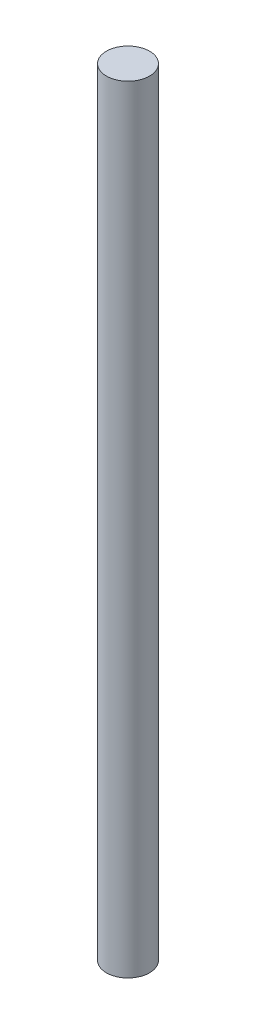
ISO-10303-21;
HEADER;
FILE_DESCRIPTION(('STEP AP214'),'2;1');
FILE_NAME('part.step','',(''),(''),'','','');
FILE_SCHEMA(('AUTOMOTIVE_DESIGN { 1 0 10303 214 1 1 1 1 }'));
ENDSEC;
DATA;
#1=APPLICATION_CONTEXT('core data for automotive mechanical design processes');
#2=APPLICATION_PROTOCOL_DEFINITION('international standard','automotive_design',2000,#1);
#3=PRODUCT_CONTEXT('',#1,'mechanical');
#4=PRODUCT('Part','Part','',(#3));
#5=PRODUCT_RELATED_PRODUCT_CATEGORY('part','',(#4));
#6=PRODUCT_DEFINITION_FORMATION('','',#4);
#7=PRODUCT_DEFINITION_CONTEXT('part definition',#1,'design');
#8=PRODUCT_DEFINITION('design','',#6,#7);
#9=PRODUCT_DEFINITION_SHAPE('','',#8);
#10=(LENGTH_UNIT() NAMED_UNIT(*) SI_UNIT(.MILLI.,.METRE.));
#11=(NAMED_UNIT(*) PLANE_ANGLE_UNIT() SI_UNIT($,.RADIAN.));
#12=(NAMED_UNIT(*) SI_UNIT($,.STERADIAN.) SOLID_ANGLE_UNIT());
#13=UNCERTAINTY_MEASURE_WITH_UNIT(LENGTH_MEASURE(1.E-05),#10,'distance_accuracy_value','');
#14=(GEOMETRIC_REPRESENTATION_CONTEXT(3) GLOBAL_UNCERTAINTY_ASSIGNED_CONTEXT((#13)) GLOBAL_UNIT_ASSIGNED_CONTEXT((#10,
#11,#12)) REPRESENTATION_CONTEXT('',''));
#15=CARTESIAN_POINT('',(0.,0.,0.));
#16=DIRECTION('',(0.,0.,1.));
#17=DIRECTION('',(1.,0.,0.));
#18=AXIS2_PLACEMENT_3D('',#15,#16,#17);
#19=CARTESIAN_POINT('',(0.,90.0000000000001,0.));
#20=DIRECTION('',(0.,-1.,0.));
#21=DIRECTION('',(0.,0.,-1.));
#22=AXIS2_PLACEMENT_3D('',#19,#20,#21);
#23=CYLINDRICAL_SURFACE('',#22,2.5);
#24=CARTESIAN_POINT('',(0.,90.0000000000001,0.));
#25=DIRECTION('',(0.,1.,0.));
#26=DIRECTION('',(0.,0.,1.));
#27=AXIS2_PLACEMENT_3D('',#24,#25,#26);
#28=CIRCLE('',#27,2.5);
#29=CARTESIAN_POINT('',(0.,90.0000000000001,2.5));
#30=VERTEX_POINT('',#29);
#31=EDGE_CURVE('E10',#30,#30,#28,.T.);
#32=ORIENTED_EDGE('',*,*,#31,.F.);
#33=EDGE_LOOP('',(#32));
#34=FACE_BOUND('',#33,.T.);
#35=CARTESIAN_POINT('',(0.,0.,0.));
#36=DIRECTION('',(0.,1.,0.));
#37=DIRECTION('',(0.,0.,1.));
#38=AXIS2_PLACEMENT_3D('',#35,#36,#37);
#39=CIRCLE('',#38,2.5);
#40=CARTESIAN_POINT('',(0.,0.,2.5));
#41=VERTEX_POINT('',#40);
#42=EDGE_CURVE('E34',#41,#41,#39,.T.);
#43=ORIENTED_EDGE('',*,*,#42,.T.);
#44=EDGE_LOOP('',(#43));
#45=FACE_BOUND('',#44,.T.);
#46=ADVANCED_FACE('F31',(#34,#45),#23,.T.);
#47=CARTESIAN_POINT('',(0.,90.0000000000001,0.));
#48=DIRECTION('',(0.,1.,0.));
#49=DIRECTION('',(0.,0.,1.));
#50=AXIS2_PLACEMENT_3D('',#47,#48,#49);
#51=PLANE('',#50);
#52=ORIENTED_EDGE('',*,*,#31,.T.);
#53=EDGE_LOOP('',(#52));
#54=FACE_BOUND('',#53,.T.);
#55=ADVANCED_FACE('F46',(#54),#51,.T.);
#56=CARTESIAN_POINT('',(0.,0.,0.));
#57=DIRECTION('',(0.,1.,0.));
#58=DIRECTION('',(0.,0.,1.));
#59=AXIS2_PLACEMENT_3D('',#56,#57,#58);
#60=PLANE('',#59);
#61=ORIENTED_EDGE('',*,*,#42,.F.);
#62=EDGE_LOOP('',(#61));
#63=FACE_BOUND('',#62,.T.);
#64=ADVANCED_FACE('F44',(#63),#60,.F.);
#65=CLOSED_SHELL('',(#46,#55,#64));
#66=MANIFOLD_SOLID_BREP('B2',#65);
#67=ADVANCED_BREP_SHAPE_REPRESENTATION('',(#18,#66),#14);
#68=SHAPE_DEFINITION_REPRESENTATION(#9,#67);
ENDSEC;
END-ISO-10303-21;
